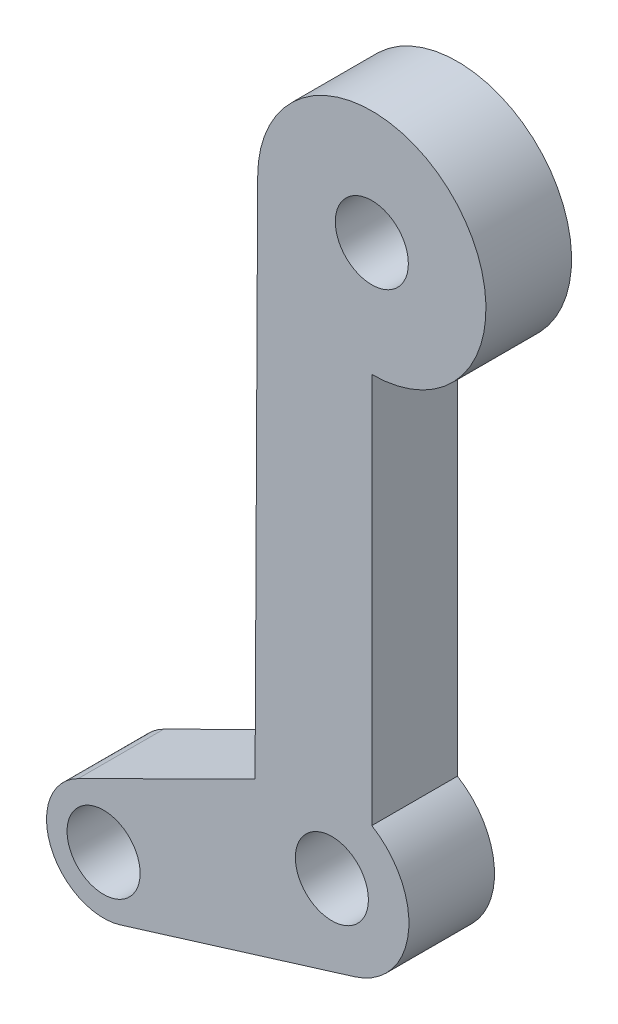
ISO-10303-21;
HEADER;
FILE_DESCRIPTION(('STEP AP214'),'2;1');
FILE_NAME('part.step','',(''),(''),'','','');
FILE_SCHEMA(('AUTOMOTIVE_DESIGN { 1 0 10303 214 1 1 1 1 }'));
ENDSEC;
DATA;
#1=APPLICATION_CONTEXT('core data for automotive mechanical design processes');
#2=APPLICATION_PROTOCOL_DEFINITION('international standard','automotive_design',2000,#1);
#3=PRODUCT_CONTEXT('',#1,'mechanical');
#4=PRODUCT('Part','Part','',(#3));
#5=PRODUCT_RELATED_PRODUCT_CATEGORY('part','',(#4));
#6=PRODUCT_DEFINITION_FORMATION('','',#4);
#7=PRODUCT_DEFINITION_CONTEXT('part definition',#1,'design');
#8=PRODUCT_DEFINITION('design','',#6,#7);
#9=PRODUCT_DEFINITION_SHAPE('','',#8);
#10=(LENGTH_UNIT() NAMED_UNIT(*) SI_UNIT(.MILLI.,.METRE.));
#11=(NAMED_UNIT(*) PLANE_ANGLE_UNIT() SI_UNIT($,.RADIAN.));
#12=(NAMED_UNIT(*) SI_UNIT($,.STERADIAN.) SOLID_ANGLE_UNIT());
#13=UNCERTAINTY_MEASURE_WITH_UNIT(LENGTH_MEASURE(1.E-05),#10,'distance_accuracy_value','');
#14=(GEOMETRIC_REPRESENTATION_CONTEXT(3) GLOBAL_UNCERTAINTY_ASSIGNED_CONTEXT((#13)) GLOBAL_UNIT_ASSIGNED_CONTEXT((#10,
#11,#12)) REPRESENTATION_CONTEXT('',''));
#15=CARTESIAN_POINT('',(0.,0.,0.));
#16=DIRECTION('',(0.,0.,1.));
#17=DIRECTION('',(1.,0.,0.));
#18=AXIS2_PLACEMENT_3D('',#15,#16,#17);
#19=CARTESIAN_POINT('',(0.,0.,3.75));
#20=DIRECTION('',(0.,0.,1.));
#21=DIRECTION('',(1.,0.,0.));
#22=AXIS2_PLACEMENT_3D('',#19,#20,#21);
#23=PLANE('',#22);
#24=CARTESIAN_POINT('',(0.,0.,3.75));
#25=DIRECTION('',(0.,0.,1.));
#26=DIRECTION('',(1.,0.,0.));
#27=AXIS2_PLACEMENT_3D('',#24,#25,#26);
#28=CIRCLE('',#27,1.6);
#29=CARTESIAN_POINT('',(1.6,0.,3.75));
#30=VERTEX_POINT('',#29);
#31=EDGE_CURVE('E147',#30,#30,#28,.T.);
#32=ORIENTED_EDGE('',*,*,#31,.F.);
#33=EDGE_LOOP('',(#32));
#34=FACE_BOUND('',#33,.T.);
#35=CARTESIAN_POINT('',(-11.75,-29.,3.75));
#36=DIRECTION('',(0.,0.,1.));
#37=DIRECTION('',(1.,0.,0.));
#38=AXIS2_PLACEMENT_3D('',#35,#36,#37);
#39=CIRCLE('',#38,2.5);
#40=CARTESIAN_POINT('',(-12.863985131321,-26.7619121716975,3.75));
#41=VERTEX_POINT('',#40);
#42=CARTESIAN_POINT('',(-11.0131700410928,-31.388949897268,3.75));
#43=VERTEX_POINT('',#42);
#44=EDGE_CURVE('E197',#41,#43,#39,.T.);
#45=ORIENTED_EDGE('',*,*,#44,.T.);
#46=DIRECTION('',(0.955579958907202,0.294731983562881,0.));
#47=VECTOR('',#46,1.);
#48=CARTESIAN_POINT('',(7.88370271433002,-25.5605388486412,3.75));
#49=LINE('',#48,#47);
#50=CARTESIAN_POINT('',(-0.755279555475276,-28.2250823613118,3.75));
#51=VERTEX_POINT('',#50);
#52=EDGE_CURVE('E112',#43,#51,#49,.T.);
#53=ORIENTED_EDGE('',*,*,#52,.T.);
#54=CARTESIAN_POINT('',(-1.75,-25.,3.75));
#55=DIRECTION('',(0.,0.,1.));
#56=DIRECTION('',(1.,0.,0.));
#57=AXIS2_PLACEMENT_3D('',#54,#55,#56);
#58=CIRCLE('',#57,3.375);
#59=CARTESIAN_POINT('',(0.,-22.1141509048462,3.75));
#60=VERTEX_POINT('',#59);
#61=EDGE_CURVE('E187',#51,#60,#58,.T.);
#62=ORIENTED_EDGE('',*,*,#61,.T.);
#63=DIRECTION('',(0.,-1.,0.));
#64=VECTOR('',#63,1.);
#65=CARTESIAN_POINT('',(0.,0.,3.75));
#66=LINE('',#65,#64);
#67=CARTESIAN_POINT('',(0.,-5.,3.75));
#68=VERTEX_POINT('',#67);
#69=EDGE_CURVE('E132',#68,#60,#66,.T.);
#70=ORIENTED_EDGE('',*,*,#69,.F.);
#71=CARTESIAN_POINT('',(0.,0.,3.75));
#72=DIRECTION('',(0.,0.,1.));
#73=DIRECTION('',(1.,0.,0.));
#74=AXIS2_PLACEMENT_3D('',#71,#72,#73);
#75=CIRCLE('',#74,5.);
#76=CARTESIAN_POINT('',(-5.,0.,3.75));
#77=VERTEX_POINT('',#76);
#78=EDGE_CURVE('E125',#68,#77,#75,.T.);
#79=ORIENTED_EDGE('',*,*,#78,.T.);
#80=DIRECTION('',(-0.00500162606728511,-0.999987491790114,0.));
#81=VECTOR('',#80,1.);
#82=CARTESIAN_POINT('',(-4.99987491868342,0.0250078175294824,3.75));
#83=LINE('',#82,#81);
#84=CARTESIAN_POINT('',(-5.11456226193698,-22.9047168714754,3.75));
#85=VERTEX_POINT('',#84);
#86=EDGE_CURVE('E130',#77,#85,#83,.T.);
#87=ORIENTED_EDGE('',*,*,#86,.T.);
#88=DIRECTION('',(0.895235131320995,0.445594052528398,0.));
#89=VECTOR('',#88,1.);
#90=CARTESIAN_POINT('',(8.12143672160933,-16.3166349028452,3.75));
#91=LINE('',#90,#89);
#92=EDGE_CURVE('E145',#41,#85,#91,.T.);
#93=ORIENTED_EDGE('',*,*,#92,.F.);
#94=EDGE_LOOP('',(#45,#53,#62,#70,#79,#87,#93));
#95=FACE_BOUND('',#94,.T.);
#96=CARTESIAN_POINT('',(-11.75,-29.,3.75));
#97=DIRECTION('',(0.,0.,1.));
#98=DIRECTION('',(1.,0.,0.));
#99=AXIS2_PLACEMENT_3D('',#96,#97,#98);
#100=CIRCLE('',#99,1.6);
#101=CARTESIAN_POINT('',(-10.15,-29.,3.75));
#102=VERTEX_POINT('',#101);
#103=EDGE_CURVE('E176',#102,#102,#100,.T.);
#104=ORIENTED_EDGE('',*,*,#103,.F.);
#105=EDGE_LOOP('',(#104));
#106=FACE_BOUND('',#105,.T.);
#107=CARTESIAN_POINT('',(-1.75,-25.,3.75));
#108=DIRECTION('',(0.,0.,1.));
#109=DIRECTION('',(1.,0.,0.));
#110=AXIS2_PLACEMENT_3D('',#107,#108,#109);
#111=CIRCLE('',#110,1.6);
#112=CARTESIAN_POINT('',(-0.149999999999997,-25.,3.75));
#113=VERTEX_POINT('',#112);
#114=EDGE_CURVE('E157',#113,#113,#111,.T.);
#115=ORIENTED_EDGE('',*,*,#114,.F.);
#116=EDGE_LOOP('',(#115));
#117=FACE_BOUND('',#116,.T.);
#118=ADVANCED_FACE('F59',(#34,#95,#106,#117),#23,.T.);
#119=CARTESIAN_POINT('',(0.,0.,0.));
#120=DIRECTION('',(0.,0.,1.));
#121=DIRECTION('',(1.,0.,0.));
#122=AXIS2_PLACEMENT_3D('',#119,#120,#121);
#123=PLANE('',#122);
#124=CARTESIAN_POINT('',(-11.75,-29.,0.));
#125=DIRECTION('',(0.,0.,1.));
#126=DIRECTION('',(1.,0.,0.));
#127=AXIS2_PLACEMENT_3D('',#124,#125,#126);
#128=CIRCLE('',#127,1.6);
#129=CARTESIAN_POINT('',(-10.15,-29.,0.));
#130=VERTEX_POINT('',#129);
#131=EDGE_CURVE('E153',#130,#130,#128,.T.);
#132=ORIENTED_EDGE('',*,*,#131,.T.);
#133=EDGE_LOOP('',(#132));
#134=FACE_BOUND('',#133,.T.);
#135=CARTESIAN_POINT('',(-11.75,-29.,0.));
#136=DIRECTION('',(0.,0.,1.));
#137=DIRECTION('',(1.,0.,0.));
#138=AXIS2_PLACEMENT_3D('',#135,#136,#137);
#139=CIRCLE('',#138,2.5);
#140=CARTESIAN_POINT('',(-12.863985131321,-26.7619121716975,0.));
#141=VERTEX_POINT('',#140);
#142=CARTESIAN_POINT('',(-11.0131700410928,-31.388949897268,0.));
#143=VERTEX_POINT('',#142);
#144=EDGE_CURVE('E156',#141,#143,#139,.T.);
#145=ORIENTED_EDGE('',*,*,#144,.F.);
#146=DIRECTION('',(0.895235131320995,0.445594052528398,0.));
#147=VECTOR('',#146,1.);
#148=CARTESIAN_POINT('',(8.12143672160933,-16.3166349028452,0.));
#149=LINE('',#148,#147);
#150=CARTESIAN_POINT('',(-5.11456226193698,-22.9047168714754,0.));
#151=VERTEX_POINT('',#150);
#152=EDGE_CURVE('E170',#141,#151,#149,.T.);
#153=ORIENTED_EDGE('',*,*,#152,.T.);
#154=DIRECTION('',(-0.00500162606728511,-0.999987491790114,0.));
#155=VECTOR('',#154,1.);
#156=CARTESIAN_POINT('',(-4.99987491868342,0.0250078175294824,0.));
#157=LINE('',#156,#155);
#158=CARTESIAN_POINT('',(-5.,0.,0.));
#159=VERTEX_POINT('',#158);
#160=EDGE_CURVE('E168',#159,#151,#157,.T.);
#161=ORIENTED_EDGE('',*,*,#160,.F.);
#162=CARTESIAN_POINT('',(0.,0.,0.));
#163=DIRECTION('',(0.,0.,1.));
#164=DIRECTION('',(1.,0.,0.));
#165=AXIS2_PLACEMENT_3D('',#162,#163,#164);
#166=CIRCLE('',#165,5.);
#167=CARTESIAN_POINT('',(0.,-5.,0.));
#168=VERTEX_POINT('',#167);
#169=EDGE_CURVE('E139',#168,#159,#166,.T.);
#170=ORIENTED_EDGE('',*,*,#169,.F.);
#171=DIRECTION('',(0.,-1.,0.));
#172=VECTOR('',#171,1.);
#173=CARTESIAN_POINT('',(0.,0.,0.));
#174=LINE('',#173,#172);
#175=CARTESIAN_POINT('',(0.,-22.1141509048462,0.));
#176=VERTEX_POINT('',#175);
#177=EDGE_CURVE('E164',#168,#176,#174,.T.);
#178=ORIENTED_EDGE('',*,*,#177,.T.);
#179=CARTESIAN_POINT('',(-1.75,-25.,0.));
#180=DIRECTION('',(0.,0.,1.));
#181=DIRECTION('',(1.,0.,0.));
#182=AXIS2_PLACEMENT_3D('',#179,#180,#181);
#183=CIRCLE('',#182,3.375);
#184=CARTESIAN_POINT('',(-0.755279555475276,-28.2250823613118,0.));
#185=VERTEX_POINT('',#184);
#186=EDGE_CURVE('E161',#185,#176,#183,.T.);
#187=ORIENTED_EDGE('',*,*,#186,.F.);
#188=DIRECTION('',(0.955579958907202,0.294731983562881,0.));
#189=VECTOR('',#188,1.);
#190=CARTESIAN_POINT('',(7.88370271433002,-25.5605388486412,0.));
#191=LINE('',#190,#189);
#192=EDGE_CURVE('E159',#143,#185,#191,.T.);
#193=ORIENTED_EDGE('',*,*,#192,.F.);
#194=EDGE_LOOP('',(#145,#153,#161,#170,#178,#187,#193));
#195=FACE_BOUND('',#194,.T.);
#196=CARTESIAN_POINT('',(0.,0.,0.));
#197=DIRECTION('',(0.,0.,1.));
#198=DIRECTION('',(1.,0.,0.));
#199=AXIS2_PLACEMENT_3D('',#196,#197,#198);
#200=CIRCLE('',#199,1.6);
#201=CARTESIAN_POINT('',(1.6,0.,0.));
#202=VERTEX_POINT('',#201);
#203=EDGE_CURVE('E173',#202,#202,#200,.T.);
#204=ORIENTED_EDGE('',*,*,#203,.T.);
#205=EDGE_LOOP('',(#204));
#206=FACE_BOUND('',#205,.T.);
#207=CARTESIAN_POINT('',(-1.75,-25.,0.));
#208=DIRECTION('',(0.,0.,1.));
#209=DIRECTION('',(1.,0.,0.));
#210=AXIS2_PLACEMENT_3D('',#207,#208,#209);
#211=CIRCLE('',#210,1.6);
#212=CARTESIAN_POINT('',(-0.149999999999997,-25.,0.));
#213=VERTEX_POINT('',#212);
#214=EDGE_CURVE('E201',#213,#213,#211,.T.);
#215=ORIENTED_EDGE('',*,*,#214,.T.);
#216=EDGE_LOOP('',(#215));
#217=FACE_BOUND('',#216,.T.);
#218=ADVANCED_FACE('F189',(#134,#195,#206,#217),#123,.F.);
#219=CARTESIAN_POINT('',(-11.75,-29.,3.75));
#220=DIRECTION('',(0.,0.,-1.));
#221=DIRECTION('',(-1.,0.,0.));
#222=AXIS2_PLACEMENT_3D('',#219,#220,#221);
#223=CYLINDRICAL_SURFACE('',#222,2.5);
#224=ORIENTED_EDGE('',*,*,#144,.T.);
#225=DIRECTION('',(0.,0.,-1.));
#226=VECTOR('',#225,1.);
#227=CARTESIAN_POINT('',(-11.0131700410928,-31.388949897268,3.75));
#228=LINE('',#227,#226);
#229=EDGE_CURVE('E12',#43,#143,#228,.T.);
#230=ORIENTED_EDGE('',*,*,#229,.F.);
#231=ORIENTED_EDGE('',*,*,#44,.F.);
#232=DIRECTION('',(0.,0.,-1.));
#233=VECTOR('',#232,1.);
#234=CARTESIAN_POINT('',(-12.863985131321,-26.7619121716975,3.75));
#235=LINE('',#234,#233);
#236=EDGE_CURVE('E76',#41,#141,#235,.T.);
#237=ORIENTED_EDGE('',*,*,#236,.T.);
#238=EDGE_LOOP('',(#224,#230,#231,#237));
#239=FACE_BOUND('',#238,.T.);
#240=ADVANCED_FACE('F216',(#239),#223,.T.);
#241=CARTESIAN_POINT('',(7.88370271433002,-25.5605388486412,3.75));
#242=DIRECTION('',(-0.294731983562881,0.955579958907202,0.));
#243=DIRECTION('',(-0.955579958907202,-0.294731983562881,0.));
#244=AXIS2_PLACEMENT_3D('',#241,#242,#243);
#245=PLANE('',#244);
#246=ORIENTED_EDGE('',*,*,#192,.T.);
#247=DIRECTION('',(0.,0.,-1.));
#248=VECTOR('',#247,1.);
#249=CARTESIAN_POINT('',(-0.755279555475276,-28.2250823613118,3.75));
#250=LINE('',#249,#248);
#251=EDGE_CURVE('E68',#51,#185,#250,.T.);
#252=ORIENTED_EDGE('',*,*,#251,.F.);
#253=ORIENTED_EDGE('',*,*,#52,.F.);
#254=ORIENTED_EDGE('',*,*,#229,.T.);
#255=EDGE_LOOP('',(#246,#252,#253,#254));
#256=FACE_BOUND('',#255,.T.);
#257=ADVANCED_FACE('F237',(#256),#245,.F.);
#258=CARTESIAN_POINT('',(-1.75,-25.,3.75));
#259=DIRECTION('',(0.,0.,-1.));
#260=DIRECTION('',(-1.,0.,0.));
#261=AXIS2_PLACEMENT_3D('',#258,#259,#260);
#262=CYLINDRICAL_SURFACE('',#261,3.375);
#263=ORIENTED_EDGE('',*,*,#186,.T.);
#264=DIRECTION('',(0.,0.,-1.));
#265=VECTOR('',#264,1.);
#266=CARTESIAN_POINT('',(0.,-22.1141509048462,3.75));
#267=LINE('',#266,#265);
#268=EDGE_CURVE('E180',#60,#176,#267,.T.);
#269=ORIENTED_EDGE('',*,*,#268,.F.);
#270=ORIENTED_EDGE('',*,*,#61,.F.);
#271=ORIENTED_EDGE('',*,*,#251,.T.);
#272=EDGE_LOOP('',(#263,#269,#270,#271));
#273=FACE_BOUND('',#272,.T.);
#274=ADVANCED_FACE('F185',(#273),#262,.T.);
#275=CARTESIAN_POINT('',(0.,0.,3.75));
#276=DIRECTION('',(1.,0.,0.));
#277=DIRECTION('',(0.,1.,0.));
#278=AXIS2_PLACEMENT_3D('',#275,#276,#277);
#279=PLANE('',#278);
#280=ORIENTED_EDGE('',*,*,#177,.F.);
#281=DIRECTION('',(0.,0.,-1.));
#282=VECTOR('',#281,1.);
#283=CARTESIAN_POINT('',(0.,-5.,3.75));
#284=LINE('',#283,#282);
#285=EDGE_CURVE('E142',#68,#168,#284,.T.);
#286=ORIENTED_EDGE('',*,*,#285,.F.);
#287=ORIENTED_EDGE('',*,*,#69,.T.);
#288=ORIENTED_EDGE('',*,*,#268,.T.);
#289=EDGE_LOOP('',(#280,#286,#287,#288));
#290=FACE_BOUND('',#289,.T.);
#291=ADVANCED_FACE('F193',(#290),#279,.T.);
#292=CARTESIAN_POINT('',(0.,0.,3.75));
#293=DIRECTION('',(0.,0.,-1.));
#294=DIRECTION('',(-1.,0.,0.));
#295=AXIS2_PLACEMENT_3D('',#292,#293,#294);
#296=CYLINDRICAL_SURFACE('',#295,5.);
#297=ORIENTED_EDGE('',*,*,#169,.T.);
#298=DIRECTION('',(0.,0.,-1.));
#299=VECTOR('',#298,1.);
#300=CARTESIAN_POINT('',(-5.,0.,3.75));
#301=LINE('',#300,#299);
#302=EDGE_CURVE('E136',#77,#159,#301,.T.);
#303=ORIENTED_EDGE('',*,*,#302,.F.);
#304=ORIENTED_EDGE('',*,*,#78,.F.);
#305=ORIENTED_EDGE('',*,*,#285,.T.);
#306=EDGE_LOOP('',(#297,#303,#304,#305));
#307=FACE_BOUND('',#306,.T.);
#308=ADVANCED_FACE('F137',(#307),#296,.T.);
#309=CARTESIAN_POINT('',(-4.99987491868342,0.0250078175294824,3.75));
#310=DIRECTION('',(0.999987491790114,-0.00500162606728511,0.));
#311=DIRECTION('',(0.00500162606728511,0.999987491790114,0.));
#312=AXIS2_PLACEMENT_3D('',#309,#310,#311);
#313=PLANE('',#312);
#314=ORIENTED_EDGE('',*,*,#160,.T.);
#315=DIRECTION('',(0.,0.,-1.));
#316=VECTOR('',#315,1.);
#317=CARTESIAN_POINT('',(-5.11456226193698,-22.9047168714754,3.75));
#318=LINE('',#317,#316);
#319=EDGE_CURVE('E100',#85,#151,#318,.T.);
#320=ORIENTED_EDGE('',*,*,#319,.F.);
#321=ORIENTED_EDGE('',*,*,#86,.F.);
#322=ORIENTED_EDGE('',*,*,#302,.T.);
#323=EDGE_LOOP('',(#314,#320,#321,#322));
#324=FACE_BOUND('',#323,.T.);
#325=ADVANCED_FACE('F144',(#324),#313,.F.);
#326=CARTESIAN_POINT('',(8.12143672160933,-16.3166349028452,3.75));
#327=DIRECTION('',(-0.445594052528398,0.895235131320995,0.));
#328=DIRECTION('',(-0.895235131320995,-0.445594052528398,0.));
#329=AXIS2_PLACEMENT_3D('',#326,#327,#328);
#330=PLANE('',#329);
#331=ORIENTED_EDGE('',*,*,#152,.F.);
#332=ORIENTED_EDGE('',*,*,#236,.F.);
#333=ORIENTED_EDGE('',*,*,#92,.T.);
#334=ORIENTED_EDGE('',*,*,#319,.T.);
#335=EDGE_LOOP('',(#331,#332,#333,#334));
#336=FACE_BOUND('',#335,.T.);
#337=ADVANCED_FACE('F226',(#336),#330,.T.);
#338=CARTESIAN_POINT('',(-11.75,-29.,3.75));
#339=DIRECTION('',(0.,0.,-1.));
#340=DIRECTION('',(-1.,0.,0.));
#341=AXIS2_PLACEMENT_3D('',#338,#339,#340);
#342=CYLINDRICAL_SURFACE('',#341,1.6);
#343=ORIENTED_EDGE('',*,*,#103,.T.);
#344=EDGE_LOOP('',(#343));
#345=FACE_BOUND('',#344,.T.);
#346=ORIENTED_EDGE('',*,*,#131,.F.);
#347=EDGE_LOOP('',(#346));
#348=FACE_BOUND('',#347,.T.);
#349=ADVANCED_FACE('F61',(#345,#348),#342,.F.);
#350=CARTESIAN_POINT('',(0.,0.,3.75));
#351=DIRECTION('',(0.,0.,-1.));
#352=DIRECTION('',(-1.,0.,0.));
#353=AXIS2_PLACEMENT_3D('',#350,#351,#352);
#354=CYLINDRICAL_SURFACE('',#353,1.6);
#355=ORIENTED_EDGE('',*,*,#31,.T.);
#356=EDGE_LOOP('',(#355));
#357=FACE_BOUND('',#356,.T.);
#358=ORIENTED_EDGE('',*,*,#203,.F.);
#359=EDGE_LOOP('',(#358));
#360=FACE_BOUND('',#359,.T.);
#361=ADVANCED_FACE('F222',(#357,#360),#354,.F.);
#362=CARTESIAN_POINT('',(-1.75,-25.,3.75));
#363=DIRECTION('',(0.,0.,-1.));
#364=DIRECTION('',(-1.,0.,0.));
#365=AXIS2_PLACEMENT_3D('',#362,#363,#364);
#366=CYLINDRICAL_SURFACE('',#365,1.6);
#367=ORIENTED_EDGE('',*,*,#114,.T.);
#368=EDGE_LOOP('',(#367));
#369=FACE_BOUND('',#368,.T.);
#370=ORIENTED_EDGE('',*,*,#214,.F.);
#371=EDGE_LOOP('',(#370));
#372=FACE_BOUND('',#371,.T.);
#373=ADVANCED_FACE('F207',(#369,#372),#366,.F.);
#374=CLOSED_SHELL('',(#118,#218,#240,#257,#274,#291,#308,#325,#337,#349,#361,#373));
#375=MANIFOLD_SOLID_BREP('B2',#374);
#376=ADVANCED_BREP_SHAPE_REPRESENTATION('',(#18,#375),#14);
#377=SHAPE_DEFINITION_REPRESENTATION(#9,#376);
ENDSEC;
END-ISO-10303-21;
